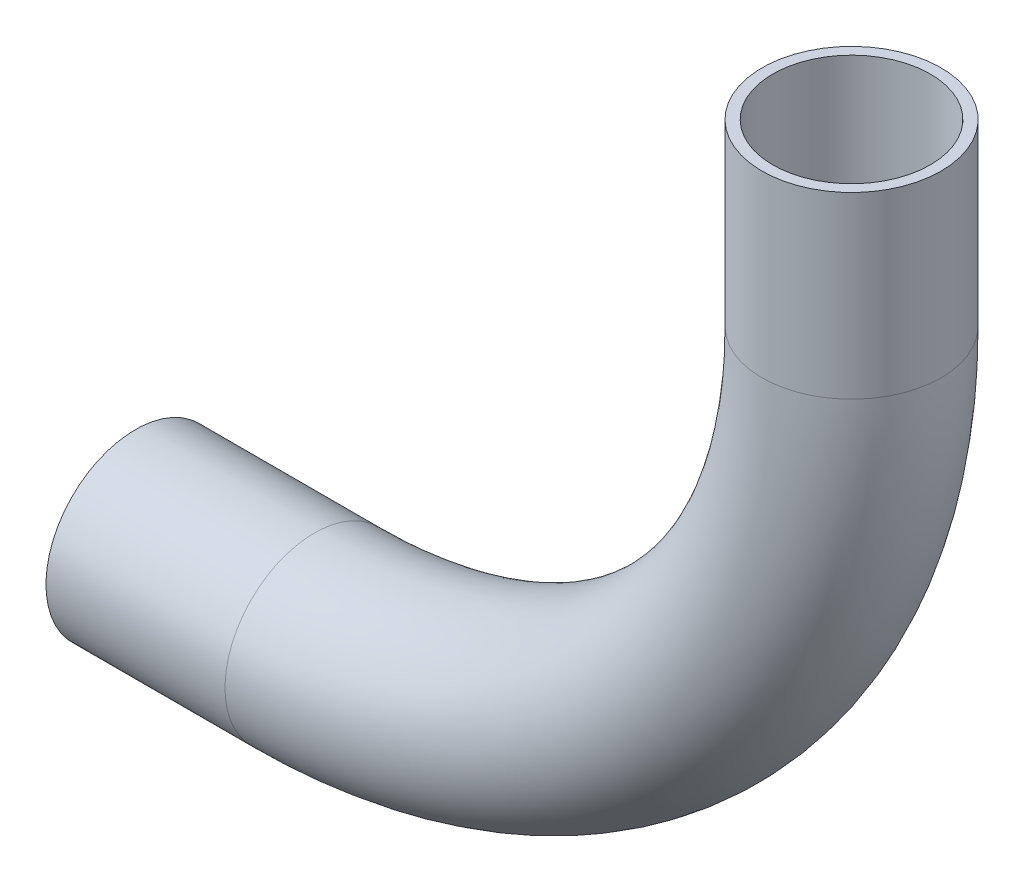
ISO-10303-21;
HEADER;
FILE_DESCRIPTION(('STEP AP214'),'2;1');
FILE_NAME('part.step','',(''),(''),'','','');
FILE_SCHEMA(('AUTOMOTIVE_DESIGN { 1 0 10303 214 1 1 1 1 }'));
ENDSEC;
DATA;
#1=APPLICATION_CONTEXT('core data for automotive mechanical design processes');
#2=APPLICATION_PROTOCOL_DEFINITION('international standard','automotive_design',2000,#1);
#3=PRODUCT_CONTEXT('',#1,'mechanical');
#4=PRODUCT('Part','Part','',(#3));
#5=PRODUCT_RELATED_PRODUCT_CATEGORY('part','',(#4));
#6=PRODUCT_DEFINITION_FORMATION('','',#4);
#7=PRODUCT_DEFINITION_CONTEXT('part definition',#1,'design');
#8=PRODUCT_DEFINITION('design','',#6,#7);
#9=PRODUCT_DEFINITION_SHAPE('','',#8);
#10=(LENGTH_UNIT() NAMED_UNIT(*) SI_UNIT(.MILLI.,.METRE.));
#11=(NAMED_UNIT(*) PLANE_ANGLE_UNIT() SI_UNIT($,.RADIAN.));
#12=(NAMED_UNIT(*) SI_UNIT($,.STERADIAN.) SOLID_ANGLE_UNIT());
#13=UNCERTAINTY_MEASURE_WITH_UNIT(LENGTH_MEASURE(1.E-05),#10,'distance_accuracy_value','');
#14=(GEOMETRIC_REPRESENTATION_CONTEXT(3) GLOBAL_UNCERTAINTY_ASSIGNED_CONTEXT((#13)) GLOBAL_UNIT_ASSIGNED_CONTEXT((#10,
#11,#12)) REPRESENTATION_CONTEXT('',''));
#15=CARTESIAN_POINT('',(0.,0.,0.));
#16=DIRECTION('',(0.,0.,1.));
#17=DIRECTION('',(1.,0.,0.));
#18=AXIS2_PLACEMENT_3D('',#15,#16,#17);
#19=CARTESIAN_POINT('',(51.1288982028881,36.3500520753419,0.));
#20=DIRECTION('',(0.,-1.,0.));
#21=DIRECTION('',(1.,0.,0.));
#22=AXIS2_PLACEMENT_3D('',#19,#20,#21);
#23=CYLINDRICAL_SURFACE('',#22,6.35);
#24=CARTESIAN_POINT('',(51.1288982028882,23.6500520753419,0.));
#25=DIRECTION('',(0.,-1.,0.));
#26=DIRECTION('',(1.,0.,0.));
#27=AXIS2_PLACEMENT_3D('',#24,#25,#26);
#28=CIRCLE('',#27,6.35);
#29=CARTESIAN_POINT('',(57.4788982028882,23.6500520753419,0.));
#30=VERTEX_POINT('',#29);
#31=EDGE_CURVE('E55',#30,#30,#28,.T.);
#32=ORIENTED_EDGE('',*,*,#31,.F.);
#33=EDGE_LOOP('',(#32));
#34=FACE_BOUND('',#33,.T.);
#35=CARTESIAN_POINT('',(51.1288982028881,36.3500520753419,0.));
#36=DIRECTION('',(0.,-1.,0.));
#37=DIRECTION('',(1.,0.,0.));
#38=AXIS2_PLACEMENT_3D('',#35,#36,#37);
#39=CIRCLE('',#38,6.35);
#40=CARTESIAN_POINT('',(57.4788982028881,36.3500520753419,0.));
#41=VERTEX_POINT('',#40);
#42=EDGE_CURVE('E53',#41,#41,#39,.T.);
#43=ORIENTED_EDGE('',*,*,#42,.T.);
#44=EDGE_LOOP('',(#43));
#45=FACE_BOUND('',#44,.T.);
#46=ADVANCED_FACE('F32',(#34,#45),#23,.T.);
#47=CARTESIAN_POINT('',(13.0288982028883,23.6500520753419,0.));
#48=DIRECTION('',(0.,0.,-1.));
#49=DIRECTION('',(-1.,0.,0.));
#50=AXIS2_PLACEMENT_3D('',#47,#48,#49);
#51=TOROIDAL_SURFACE('',#50,38.0999999999999,6.35);
#52=CARTESIAN_POINT('',(13.0288982028882,-14.4499479246581,0.));
#53=DIRECTION('',(-1.,0.,0.));
#54=DIRECTION('',(0.,-1.,0.));
#55=AXIS2_PLACEMENT_3D('',#52,#53,#54);
#56=CIRCLE('',#55,6.35);
#57=CARTESIAN_POINT('',(13.0288982028881,-20.7999479246579,0.));
#58=VERTEX_POINT('',#57);
#59=EDGE_CURVE('E36',#58,#58,#56,.T.);
#60=CARTESIAN_POINT('',(13.0288982028883,23.6500520753419,0.));
#61=DIRECTION('',(0.,0.,-1.));
#62=DIRECTION('',(-1.,0.,0.));
#63=AXIS2_PLACEMENT_3D('',#60,#61,#62);
#64=CIRCLE('',#63,44.4499999999999);
#65=EDGE_CURVE('',#30,#58,#64,.T.);
#66=ORIENTED_EDGE('',*,*,#31,.T.);
#67=ORIENTED_EDGE('',*,*,#59,.F.);
#68=ORIENTED_EDGE('',*,*,#65,.T.);
#69=ORIENTED_EDGE('',*,*,#65,.F.);
#70=EDGE_LOOP('',(#66,#68,#67,#69));
#71=FACE_BOUND('',#70,.T.);
#72=ADVANCED_FACE('F63',(#71),#51,.T.);
#73=CARTESIAN_POINT('',(13.0288982028882,-14.4499479246582,0.));
#74=DIRECTION('',(-1.,0.,0.));
#75=DIRECTION('',(0.,0.,1.));
#76=AXIS2_PLACEMENT_3D('',#73,#74,#75);
#77=CYLINDRICAL_SURFACE('',#76,6.35);
#78=CARTESIAN_POINT('',(0.328898202888159,-14.4499479246582,0.));
#79=DIRECTION('',(-1.,0.,0.));
#80=DIRECTION('',(0.,-1.,0.));
#81=AXIS2_PLACEMENT_3D('',#78,#79,#80);
#82=CIRCLE('',#81,6.35);
#83=CARTESIAN_POINT('',(0.328898202888165,-20.7999479246582,0.));
#84=VERTEX_POINT('',#83);
#85=EDGE_CURVE('E49',#84,#84,#82,.T.);
#86=ORIENTED_EDGE('',*,*,#85,.F.);
#87=EDGE_LOOP('',(#86));
#88=FACE_BOUND('',#87,.T.);
#89=ORIENTED_EDGE('',*,*,#59,.T.);
#90=EDGE_LOOP('',(#89));
#91=FACE_BOUND('',#90,.T.);
#92=ADVANCED_FACE('F34',(#88,#91),#77,.T.);
#93=CARTESIAN_POINT('',(51.1288982028881,36.3500520753419,0.));
#94=DIRECTION('',(0.,-1.,0.));
#95=DIRECTION('',(1.,0.,0.));
#96=AXIS2_PLACEMENT_3D('',#93,#94,#95);
#97=PLANE('',#96);
#98=CARTESIAN_POINT('',(51.1288982028881,36.3500520753419,0.));
#99=DIRECTION('',(0.,-1.,0.));
#100=DIRECTION('',(1.,0.,0.));
#101=AXIS2_PLACEMENT_3D('',#98,#99,#100);
#102=CIRCLE('',#101,5.588);
#103=CARTESIAN_POINT('',(56.7168982028881,36.3500520753419,0.));
#104=VERTEX_POINT('',#103);
#105=EDGE_CURVE('E52',#104,#104,#102,.F.);
#106=ORIENTED_EDGE('',*,*,#105,.F.);
#107=EDGE_LOOP('',(#106));
#108=FACE_BOUND('',#107,.T.);
#109=ORIENTED_EDGE('',*,*,#42,.F.);
#110=EDGE_LOOP('',(#109));
#111=FACE_BOUND('',#110,.T.);
#112=ADVANCED_FACE('F69',(#108,#111),#97,.F.);
#113=CARTESIAN_POINT('',(0.328898202888159,-14.4499479246582,0.));
#114=DIRECTION('',(-1.,0.,0.));
#115=DIRECTION('',(0.,-1.,0.));
#116=AXIS2_PLACEMENT_3D('',#113,#114,#115);
#117=PLANE('',#116);
#118=CARTESIAN_POINT('',(0.328898202888159,-14.4499479246582,0.));
#119=DIRECTION('',(-1.,0.,0.));
#120=DIRECTION('',(0.,-1.,0.));
#121=AXIS2_PLACEMENT_3D('',#118,#119,#120);
#122=CIRCLE('',#121,5.588);
#123=CARTESIAN_POINT('',(0.328898202888164,-20.0379479246582,0.));
#124=VERTEX_POINT('',#123);
#125=EDGE_CURVE('E10',#124,#124,#122,.F.);
#126=ORIENTED_EDGE('',*,*,#125,.T.);
#127=EDGE_LOOP('',(#126));
#128=FACE_BOUND('',#127,.T.);
#129=ORIENTED_EDGE('',*,*,#85,.T.);
#130=EDGE_LOOP('',(#129));
#131=FACE_BOUND('',#130,.T.);
#132=ADVANCED_FACE('F87',(#128,#131),#117,.T.);
#133=CARTESIAN_POINT('',(51.1288982028881,36.3500520753419,0.));
#134=DIRECTION('',(0.,-1.,0.));
#135=DIRECTION('',(1.,0.,0.));
#136=AXIS2_PLACEMENT_3D('',#133,#134,#135);
#137=CYLINDRICAL_SURFACE('',#136,5.588);
#138=CARTESIAN_POINT('',(51.1288982028882,23.6500520753419,0.));
#139=DIRECTION('',(0.,-1.,0.));
#140=DIRECTION('',(1.,0.,0.));
#141=AXIS2_PLACEMENT_3D('',#138,#139,#140);
#142=CIRCLE('',#141,5.588);
#143=CARTESIAN_POINT('',(56.7168982028882,23.6500520753419,0.));
#144=VERTEX_POINT('',#143);
#145=EDGE_CURVE('E45',#144,#144,#142,.F.);
#146=ORIENTED_EDGE('',*,*,#145,.F.);
#147=EDGE_LOOP('',(#146));
#148=FACE_BOUND('',#147,.T.);
#149=ORIENTED_EDGE('',*,*,#105,.T.);
#150=EDGE_LOOP('',(#149));
#151=FACE_BOUND('',#150,.T.);
#152=ADVANCED_FACE('F81',(#148,#151),#137,.F.);
#153=CARTESIAN_POINT('',(13.0288982028883,23.6500520753419,0.));
#154=DIRECTION('',(0.,0.,-1.));
#155=DIRECTION('',(-1.,0.,0.));
#156=AXIS2_PLACEMENT_3D('',#153,#154,#155);
#157=TOROIDAL_SURFACE('',#156,38.0999999999999,5.588);
#158=CARTESIAN_POINT('',(13.0288982028882,-14.4499479246581,0.));
#159=DIRECTION('',(-1.,0.,0.));
#160=DIRECTION('',(0.,-1.,0.));
#161=AXIS2_PLACEMENT_3D('',#158,#159,#160);
#162=CIRCLE('',#161,5.588);
#163=CARTESIAN_POINT('',(13.0288982028881,-20.037947924658,0.));
#164=VERTEX_POINT('',#163);
#165=EDGE_CURVE('E40',#164,#164,#162,.F.);
#166=CARTESIAN_POINT('',(13.0288982028883,23.6500520753419,0.));
#167=DIRECTION('',(0.,0.,-1.));
#168=DIRECTION('',(-1.,0.,0.));
#169=AXIS2_PLACEMENT_3D('',#166,#167,#168);
#170=CIRCLE('',#169,43.6879999999999);
#171=EDGE_CURVE('',#144,#164,#170,.T.);
#172=ORIENTED_EDGE('',*,*,#145,.T.);
#173=ORIENTED_EDGE('',*,*,#165,.F.);
#174=ORIENTED_EDGE('',*,*,#171,.T.);
#175=ORIENTED_EDGE('',*,*,#171,.F.);
#176=EDGE_LOOP('',(#172,#174,#173,#175));
#177=FACE_BOUND('',#176,.T.);
#178=ADVANCED_FACE('F75',(#177),#157,.F.);
#179=CARTESIAN_POINT('',(13.0288982028882,-14.4499479246582,0.));
#180=DIRECTION('',(-1.,0.,0.));
#181=DIRECTION('',(0.,0.,1.));
#182=AXIS2_PLACEMENT_3D('',#179,#180,#181);
#183=CYLINDRICAL_SURFACE('',#182,5.588);
#184=ORIENTED_EDGE('',*,*,#125,.F.);
#185=EDGE_LOOP('',(#184));
#186=FACE_BOUND('',#185,.T.);
#187=ORIENTED_EDGE('',*,*,#165,.T.);
#188=EDGE_LOOP('',(#187));
#189=FACE_BOUND('',#188,.T.);
#190=ADVANCED_FACE('F73',(#186,#189),#183,.F.);
#191=CLOSED_SHELL('',(#46,#72,#92,#112,#132,#152,#178,#190));
#192=MANIFOLD_SOLID_BREP('B2',#191);
#193=ADVANCED_BREP_SHAPE_REPRESENTATION('',(#18,#192),#14);
#194=SHAPE_DEFINITION_REPRESENTATION(#9,#193);
ENDSEC;
END-ISO-10303-21;
